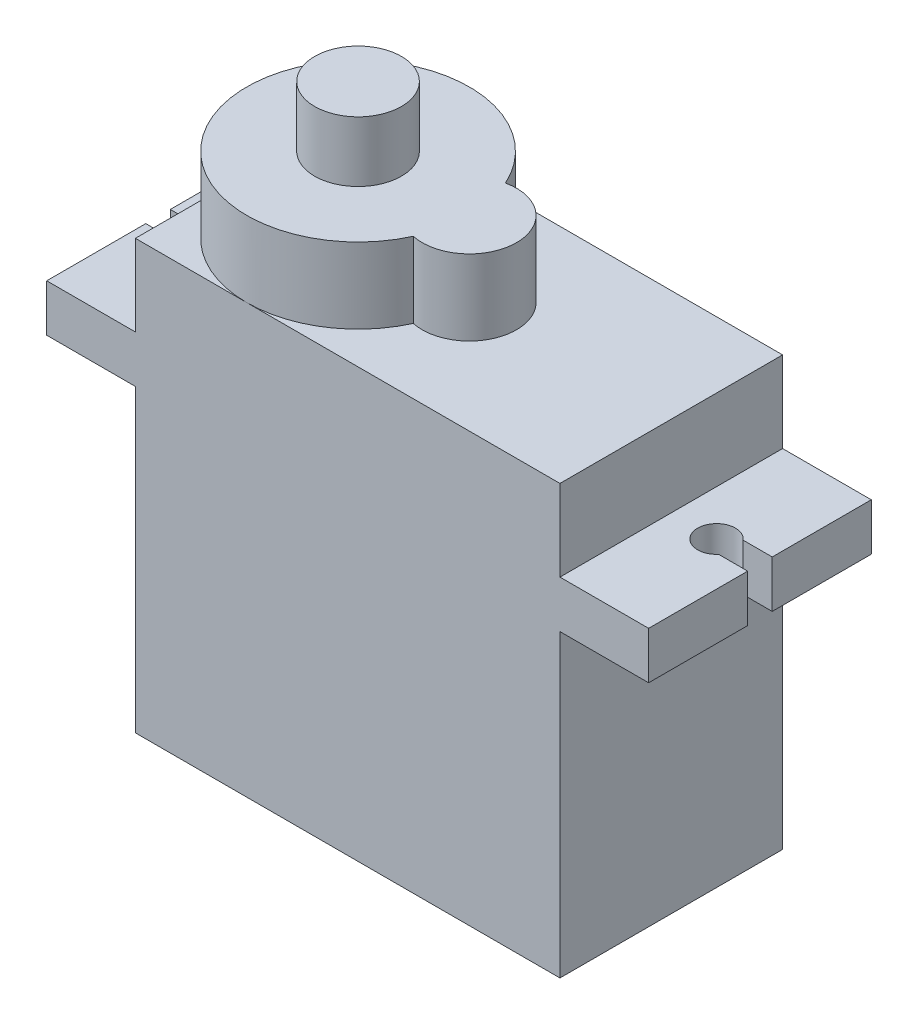
ISO-10303-21;
HEADER;
FILE_DESCRIPTION(('STEP AP214'),'2;1');
FILE_NAME('part.step','',(''),(''),'','','');
FILE_SCHEMA(('AUTOMOTIVE_DESIGN { 1 0 10303 214 1 1 1 1 }'));
ENDSEC;
DATA;
#1=APPLICATION_CONTEXT('core data for automotive mechanical design processes');
#2=APPLICATION_PROTOCOL_DEFINITION('international standard','automotive_design',2000,#1);
#3=PRODUCT_CONTEXT('',#1,'mechanical');
#4=PRODUCT('Part','Part','',(#3));
#5=PRODUCT_RELATED_PRODUCT_CATEGORY('part','',(#4));
#6=PRODUCT_DEFINITION_FORMATION('','',#4);
#7=PRODUCT_DEFINITION_CONTEXT('part definition',#1,'design');
#8=PRODUCT_DEFINITION('design','',#6,#7);
#9=PRODUCT_DEFINITION_SHAPE('','',#8);
#10=(LENGTH_UNIT() NAMED_UNIT(*) SI_UNIT(.MILLI.,.METRE.));
#11=(NAMED_UNIT(*) PLANE_ANGLE_UNIT() SI_UNIT($,.RADIAN.));
#12=(NAMED_UNIT(*) SI_UNIT($,.STERADIAN.) SOLID_ANGLE_UNIT());
#13=UNCERTAINTY_MEASURE_WITH_UNIT(LENGTH_MEASURE(1.E-05),#10,'distance_accuracy_value','');
#14=(GEOMETRIC_REPRESENTATION_CONTEXT(3) GLOBAL_UNCERTAINTY_ASSIGNED_CONTEXT((#13)) GLOBAL_UNIT_ASSIGNED_CONTEXT((#10,
#11,#12)) REPRESENTATION_CONTEXT('',''));
#15=CARTESIAN_POINT('',(0.,0.,0.));
#16=DIRECTION('',(0.,0.,1.));
#17=DIRECTION('',(1.,0.,0.));
#18=AXIS2_PLACEMENT_3D('',#15,#16,#17);
#19=CARTESIAN_POINT('',(-4.7,18.4,11.8));
#20=DIRECTION('',(1.,0.,0.));
#21=DIRECTION('',(0.,0.,-1.));
#22=AXIS2_PLACEMENT_3D('',#19,#20,#21);
#23=PLANE('',#22);
#24=DIRECTION('',(0.,0.,-1.));
#25=VECTOR('',#24,1.);
#26=CARTESIAN_POINT('',(-4.7,15.9,11.8));
#27=LINE('',#26,#25);
#28=CARTESIAN_POINT('',(-4.7,15.9,5.25));
#29=VERTEX_POINT('',#28);
#30=CARTESIAN_POINT('',(-4.7,15.9,0.));
#31=VERTEX_POINT('',#30);
#32=EDGE_CURVE('E376',#29,#31,#27,.T.);
#33=ORIENTED_EDGE('',*,*,#32,.F.);
#34=DIRECTION('',(0.,1.,0.));
#35=VECTOR('',#34,1.);
#36=CARTESIAN_POINT('',(-4.7,15.2,5.25));
#37=LINE('',#36,#35);
#38=CARTESIAN_POINT('',(-4.7,18.4,5.25));
#39=VERTEX_POINT('',#38);
#40=EDGE_CURVE('E264',#29,#39,#37,.T.);
#41=ORIENTED_EDGE('',*,*,#40,.T.);
#42=DIRECTION('',(0.,0.,-1.));
#43=VECTOR('',#42,1.);
#44=CARTESIAN_POINT('',(-4.7,18.4,11.8));
#45=LINE('',#44,#43);
#46=CARTESIAN_POINT('',(-4.7,18.4,0.));
#47=VERTEX_POINT('',#46);
#48=EDGE_CURVE('E218',#39,#47,#45,.T.);
#49=ORIENTED_EDGE('',*,*,#48,.T.);
#50=DIRECTION('',(0.,-1.,0.));
#51=VECTOR('',#50,1.);
#52=CARTESIAN_POINT('',(-4.7,18.4,0.));
#53=LINE('',#52,#51);
#54=EDGE_CURVE('E372',#47,#31,#53,.T.);
#55=ORIENTED_EDGE('',*,*,#54,.T.);
#56=EDGE_LOOP('',(#33,#41,#49,#55));
#57=FACE_BOUND('',#56,.T.);
#58=ADVANCED_FACE('F34',(#57),#23,.F.);
#59=CARTESIAN_POINT('',(27.2,15.9,11.8));
#60=DIRECTION('',(-1.,0.,0.));
#61=DIRECTION('',(0.,0.,1.));
#62=AXIS2_PLACEMENT_3D('',#59,#60,#61);
#63=PLANE('',#62);
#64=DIRECTION('',(0.,0.,-1.));
#65=VECTOR('',#64,1.);
#66=CARTESIAN_POINT('',(27.2,15.9,11.8));
#67=LINE('',#66,#65);
#68=CARTESIAN_POINT('',(27.2,15.9,11.8));
#69=VERTEX_POINT('',#68);
#70=CARTESIAN_POINT('',(27.2,15.9,6.55));
#71=VERTEX_POINT('',#70);
#72=EDGE_CURVE('E241',#69,#71,#67,.T.);
#73=ORIENTED_EDGE('',*,*,#72,.T.);
#74=DIRECTION('',(0.,1.,0.));
#75=VECTOR('',#74,1.);
#76=CARTESIAN_POINT('',(27.2,15.2,6.55));
#77=LINE('',#76,#75);
#78=CARTESIAN_POINT('',(27.2,18.4,6.55));
#79=VERTEX_POINT('',#78);
#80=EDGE_CURVE('E278',#71,#79,#77,.T.);
#81=ORIENTED_EDGE('',*,*,#80,.T.);
#82=DIRECTION('',(0.,0.,-1.));
#83=VECTOR('',#82,1.);
#84=CARTESIAN_POINT('',(27.2,18.4,11.8));
#85=LINE('',#84,#83);
#86=CARTESIAN_POINT('',(27.2,18.4,11.8));
#87=VERTEX_POINT('',#86);
#88=EDGE_CURVE('E237',#87,#79,#85,.T.);
#89=ORIENTED_EDGE('',*,*,#88,.F.);
#90=DIRECTION('',(0.,1.,0.));
#91=VECTOR('',#90,1.);
#92=CARTESIAN_POINT('',(27.2,15.9,11.8));
#93=LINE('',#92,#91);
#94=EDGE_CURVE('E329',#69,#87,#93,.T.);
#95=ORIENTED_EDGE('',*,*,#94,.F.);
#96=EDGE_LOOP('',(#73,#81,#89,#95));
#97=FACE_BOUND('',#96,.T.);
#98=ADVANCED_FACE('F409',(#97),#63,.F.);
#99=CARTESIAN_POINT('',(22.5,22.7,11.8));
#100=DIRECTION('',(0.,-1.,0.));
#101=DIRECTION('',(0.,0.,-1.));
#102=AXIS2_PLACEMENT_3D('',#99,#100,#101);
#103=PLANE('',#102);
#104=CARTESIAN_POINT('',(11.8,22.7,5.9));
#105=DIRECTION('',(0.,1.,0.));
#106=DIRECTION('',(0.,0.,1.));
#107=AXIS2_PLACEMENT_3D('',#104,#105,#106);
#108=CIRCLE('',#107,2.5);
#109=CARTESIAN_POINT('',(11.2703389830509,22.7,8.34324767617293));
#110=VERTEX_POINT('',#109);
#111=CARTESIAN_POINT('',(11.2703389830509,22.7,3.45675232382708));
#112=VERTEX_POINT('',#111);
#113=EDGE_CURVE('E299',#110,#112,#108,.T.);
#114=ORIENTED_EDGE('',*,*,#113,.F.);
#115=CARTESIAN_POINT('',(5.9,22.7,5.9));
#116=DIRECTION('',(0.,1.,0.));
#117=DIRECTION('',(0.,0.,1.));
#118=AXIS2_PLACEMENT_3D('',#115,#116,#117);
#119=CIRCLE('',#118,5.9);
#120=CARTESIAN_POINT('',(5.9,22.7,11.8));
#121=VERTEX_POINT('',#120);
#122=EDGE_CURVE('E253',#121,#110,#119,.T.);
#123=ORIENTED_EDGE('',*,*,#122,.F.);
#124=DIRECTION('',(-1.,0.,0.));
#125=VECTOR('',#124,1.);
#126=CARTESIAN_POINT('',(22.5,22.7,11.8));
#127=LINE('',#126,#125);
#128=CARTESIAN_POINT('',(22.5,22.7,11.8));
#129=VERTEX_POINT('',#128);
#130=EDGE_CURVE('E336',#129,#121,#127,.T.);
#131=ORIENTED_EDGE('',*,*,#130,.F.);
#132=DIRECTION('',(0.,0.,-1.));
#133=VECTOR('',#132,1.);
#134=CARTESIAN_POINT('',(22.5,22.7,11.8));
#135=LINE('',#134,#133);
#136=CARTESIAN_POINT('',(22.5,22.7,0.));
#137=VERTEX_POINT('',#136);
#138=EDGE_CURVE('E230',#129,#137,#135,.T.);
#139=ORIENTED_EDGE('',*,*,#138,.T.);
#140=DIRECTION('',(-1.,0.,0.));
#141=VECTOR('',#140,1.);
#142=CARTESIAN_POINT('',(22.5,22.7,0.));
#143=LINE('',#142,#141);
#144=CARTESIAN_POINT('',(5.9,22.7,0.));
#145=VERTEX_POINT('',#144);
#146=EDGE_CURVE('E364',#137,#145,#143,.T.);
#147=ORIENTED_EDGE('',*,*,#146,.T.);
#148=EDGE_CURVE('E306',#112,#145,#119,.T.);
#149=ORIENTED_EDGE('',*,*,#148,.F.);
#150=EDGE_LOOP('',(#114,#123,#131,#139,#147,#149));
#151=FACE_BOUND('',#150,.T.);
#152=ADVANCED_FACE('F414',(#151),#103,.F.);
#153=CARTESIAN_POINT('',(0.,22.7,5.9));
#154=VERTEX_POINT('',#153);
#155=EDGE_CURVE('E254',#145,#154,#119,.T.);
#156=ORIENTED_EDGE('',*,*,#155,.F.);
#157=CARTESIAN_POINT('',(0.,22.7,0.));
#158=VERTEX_POINT('',#157);
#159=EDGE_CURVE('E363',#145,#158,#143,.T.);
#160=ORIENTED_EDGE('',*,*,#159,.T.);
#161=DIRECTION('',(0.,0.,-1.));
#162=VECTOR('',#161,1.);
#163=CARTESIAN_POINT('',(0.,22.7,11.8));
#164=LINE('',#163,#162);
#165=EDGE_CURVE('E221',#154,#158,#164,.T.);
#166=ORIENTED_EDGE('',*,*,#165,.F.);
#167=EDGE_LOOP('',(#156,#160,#166));
#168=FACE_BOUND('',#167,.T.);
#169=ADVANCED_FACE('F436',(#168),#103,.F.);
#170=CARTESIAN_POINT('',(0.,15.9,11.8));
#171=DIRECTION('',(1.,0.,0.));
#172=DIRECTION('',(0.,0.,-1.));
#173=AXIS2_PLACEMENT_3D('',#170,#171,#172);
#174=PLANE('',#173);
#175=DIRECTION('',(0.,-1.,0.));
#176=VECTOR('',#175,1.);
#177=CARTESIAN_POINT('',(0.,15.9,0.));
#178=LINE('',#177,#176);
#179=CARTESIAN_POINT('',(0.,15.9,0.));
#180=VERTEX_POINT('',#179);
#181=CARTESIAN_POINT('',(0.,0.,0.));
#182=VERTEX_POINT('',#181);
#183=EDGE_CURVE('E318',#180,#182,#178,.T.);
#184=ORIENTED_EDGE('',*,*,#183,.T.);
#185=DIRECTION('',(0.,0.,-1.));
#186=VECTOR('',#185,1.);
#187=CARTESIAN_POINT('',(0.,0.,11.8));
#188=LINE('',#187,#186);
#189=CARTESIAN_POINT('',(0.,0.,11.8));
#190=VERTEX_POINT('',#189);
#191=EDGE_CURVE('E250',#190,#182,#188,.T.);
#192=ORIENTED_EDGE('',*,*,#191,.F.);
#193=DIRECTION('',(0.,-1.,0.));
#194=VECTOR('',#193,1.);
#195=CARTESIAN_POINT('',(0.,15.9,11.8));
#196=LINE('',#195,#194);
#197=CARTESIAN_POINT('',(0.,15.9,11.8));
#198=VERTEX_POINT('',#197);
#199=EDGE_CURVE('E319',#198,#190,#196,.T.);
#200=ORIENTED_EDGE('',*,*,#199,.F.);
#201=DIRECTION('',(0.,0.,-1.));
#202=VECTOR('',#201,1.);
#203=CARTESIAN_POINT('',(0.,15.9,11.8));
#204=LINE('',#203,#202);
#205=EDGE_CURVE('E346',#198,#180,#204,.T.);
#206=ORIENTED_EDGE('',*,*,#205,.T.);
#207=EDGE_LOOP('',(#184,#192,#200,#206));
#208=FACE_BOUND('',#207,.T.);
#209=ADVANCED_FACE('F36',(#208),#174,.F.);
#210=CARTESIAN_POINT('',(0.,0.,11.8));
#211=DIRECTION('',(0.,1.,0.));
#212=DIRECTION('',(0.,0.,1.));
#213=AXIS2_PLACEMENT_3D('',#210,#211,#212);
#214=PLANE('',#213);
#215=DIRECTION('',(1.,0.,0.));
#216=VECTOR('',#215,1.);
#217=CARTESIAN_POINT('',(0.,0.,0.));
#218=LINE('',#217,#216);
#219=CARTESIAN_POINT('',(22.5,0.,0.));
#220=VERTEX_POINT('',#219);
#221=EDGE_CURVE('E349',#182,#220,#218,.T.);
#222=ORIENTED_EDGE('',*,*,#221,.T.);
#223=DIRECTION('',(0.,0.,-1.));
#224=VECTOR('',#223,1.);
#225=CARTESIAN_POINT('',(22.5,0.,11.8));
#226=LINE('',#225,#224);
#227=CARTESIAN_POINT('',(22.5,0.,11.8));
#228=VERTEX_POINT('',#227);
#229=EDGE_CURVE('E247',#228,#220,#226,.T.);
#230=ORIENTED_EDGE('',*,*,#229,.F.);
#231=DIRECTION('',(1.,0.,0.));
#232=VECTOR('',#231,1.);
#233=CARTESIAN_POINT('',(0.,0.,11.8));
#234=LINE('',#233,#232);
#235=EDGE_CURVE('E322',#190,#228,#234,.T.);
#236=ORIENTED_EDGE('',*,*,#235,.F.);
#237=ORIENTED_EDGE('',*,*,#191,.T.);
#238=EDGE_LOOP('',(#222,#230,#236,#237));
#239=FACE_BOUND('',#238,.T.);
#240=ADVANCED_FACE('F452',(#239),#214,.F.);
#241=CARTESIAN_POINT('',(22.5,0.,11.8));
#242=DIRECTION('',(-1.,0.,0.));
#243=DIRECTION('',(0.,0.,1.));
#244=AXIS2_PLACEMENT_3D('',#241,#242,#243);
#245=PLANE('',#244);
#246=DIRECTION('',(0.,1.,0.));
#247=VECTOR('',#246,1.);
#248=CARTESIAN_POINT('',(22.5,0.,0.));
#249=LINE('',#248,#247);
#250=CARTESIAN_POINT('',(22.5,15.9,0.));
#251=VERTEX_POINT('',#250);
#252=EDGE_CURVE('E351',#220,#251,#249,.T.);
#253=ORIENTED_EDGE('',*,*,#252,.T.);
#254=DIRECTION('',(0.,0.,-1.));
#255=VECTOR('',#254,1.);
#256=CARTESIAN_POINT('',(22.5,15.9,11.8));
#257=LINE('',#256,#255);
#258=CARTESIAN_POINT('',(22.5,15.9,11.8));
#259=VERTEX_POINT('',#258);
#260=EDGE_CURVE('E244',#259,#251,#257,.T.);
#261=ORIENTED_EDGE('',*,*,#260,.F.);
#262=DIRECTION('',(0.,1.,0.));
#263=VECTOR('',#262,1.);
#264=CARTESIAN_POINT('',(22.5,0.,11.8));
#265=LINE('',#264,#263);
#266=EDGE_CURVE('E325',#228,#259,#265,.T.);
#267=ORIENTED_EDGE('',*,*,#266,.F.);
#268=ORIENTED_EDGE('',*,*,#229,.T.);
#269=EDGE_LOOP('',(#253,#261,#267,#268));
#270=FACE_BOUND('',#269,.T.);
#271=ADVANCED_FACE('F449',(#270),#245,.F.);
#272=CARTESIAN_POINT('',(22.5,15.9,11.8));
#273=DIRECTION('',(0.,1.,0.));
#274=DIRECTION('',(0.,0.,1.));
#275=AXIS2_PLACEMENT_3D('',#272,#273,#274);
#276=PLANE('',#275);
#277=CARTESIAN_POINT('',(24.9,15.9,5.9));
#278=DIRECTION('',(0.,1.,0.));
#279=DIRECTION('',(0.,0.,1.));
#280=AXIS2_PLACEMENT_3D('',#277,#278,#279);
#281=CIRCLE('',#280,1.);
#282=CARTESIAN_POINT('',(25.6599342076785,15.9,5.25));
#283=VERTEX_POINT('',#282);
#284=CARTESIAN_POINT('',(25.6599342076785,15.9,6.55));
#285=VERTEX_POINT('',#284);
#286=EDGE_CURVE('E289',#283,#285,#281,.T.);
#287=ORIENTED_EDGE('',*,*,#286,.T.);
#288=DIRECTION('',(1.,0.,0.));
#289=VECTOR('',#288,1.);
#290=CARTESIAN_POINT('',(22.5,15.9,6.55));
#291=LINE('',#290,#289);
#292=EDGE_CURVE('E292',#285,#71,#291,.T.);
#293=ORIENTED_EDGE('',*,*,#292,.T.);
#294=ORIENTED_EDGE('',*,*,#72,.F.);
#295=DIRECTION('',(1.,0.,0.));
#296=VECTOR('',#295,1.);
#297=CARTESIAN_POINT('',(22.5,15.9,11.8));
#298=LINE('',#297,#296);
#299=EDGE_CURVE('E327',#259,#69,#298,.T.);
#300=ORIENTED_EDGE('',*,*,#299,.F.);
#301=ORIENTED_EDGE('',*,*,#260,.T.);
#302=DIRECTION('',(1.,0.,0.));
#303=VECTOR('',#302,1.);
#304=CARTESIAN_POINT('',(22.5,15.9,0.));
#305=LINE('',#304,#303);
#306=CARTESIAN_POINT('',(27.2,15.9,0.));
#307=VERTEX_POINT('',#306);
#308=EDGE_CURVE('E353',#251,#307,#305,.T.);
#309=ORIENTED_EDGE('',*,*,#308,.T.);
#310=CARTESIAN_POINT('',(27.2,15.9,5.25));
#311=VERTEX_POINT('',#310);
#312=EDGE_CURVE('E240',#311,#307,#67,.T.);
#313=ORIENTED_EDGE('',*,*,#312,.F.);
#314=DIRECTION('',(-1.,0.,0.));
#315=VECTOR('',#314,1.);
#316=CARTESIAN_POINT('',(22.5,15.9,5.25));
#317=LINE('',#316,#315);
#318=EDGE_CURVE('E281',#311,#283,#317,.T.);
#319=ORIENTED_EDGE('',*,*,#318,.T.);
#320=EDGE_LOOP('',(#287,#293,#294,#300,#301,#309,#313,#319));
#321=FACE_BOUND('',#320,.T.);
#322=ADVANCED_FACE('F445',(#321),#276,.F.);
#323=CARTESIAN_POINT('',(27.2,18.4,5.25));
#324=VERTEX_POINT('',#323);
#325=CARTESIAN_POINT('',(27.2,18.4,0.));
#326=VERTEX_POINT('',#325);
#327=EDGE_CURVE('E236',#324,#326,#85,.T.);
#328=ORIENTED_EDGE('',*,*,#327,.F.);
#329=DIRECTION('',(0.,1.,0.));
#330=VECTOR('',#329,1.);
#331=CARTESIAN_POINT('',(27.2,15.2,5.25));
#332=LINE('',#331,#330);
#333=EDGE_CURVE('E57',#311,#324,#332,.T.);
#334=ORIENTED_EDGE('',*,*,#333,.F.);
#335=ORIENTED_EDGE('',*,*,#312,.T.);
#336=DIRECTION('',(0.,1.,0.));
#337=VECTOR('',#336,1.);
#338=CARTESIAN_POINT('',(27.2,15.9,0.));
#339=LINE('',#338,#337);
#340=EDGE_CURVE('E356',#307,#326,#339,.T.);
#341=ORIENTED_EDGE('',*,*,#340,.T.);
#342=EDGE_LOOP('',(#328,#334,#335,#341));
#343=FACE_BOUND('',#342,.T.);
#344=ADVANCED_FACE('F417',(#343),#63,.F.);
#345=CARTESIAN_POINT('',(27.2,18.4,11.8));
#346=DIRECTION('',(0.,-1.,0.));
#347=DIRECTION('',(0.,0.,-1.));
#348=AXIS2_PLACEMENT_3D('',#345,#346,#347);
#349=PLANE('',#348);
#350=ORIENTED_EDGE('',*,*,#88,.T.);
#351=DIRECTION('',(1.,0.,0.));
#352=VECTOR('',#351,1.);
#353=CARTESIAN_POINT('',(27.2,18.4,6.55));
#354=LINE('',#353,#352);
#355=CARTESIAN_POINT('',(25.6599342076785,18.4,6.55));
#356=VERTEX_POINT('',#355);
#357=EDGE_CURVE('E276',#356,#79,#354,.T.);
#358=ORIENTED_EDGE('',*,*,#357,.F.);
#359=CARTESIAN_POINT('',(24.9,18.4,5.9));
#360=DIRECTION('',(0.,1.,0.));
#361=DIRECTION('',(0.,0.,1.));
#362=AXIS2_PLACEMENT_3D('',#359,#360,#361);
#363=CIRCLE('',#362,1.);
#364=CARTESIAN_POINT('',(25.6599342076785,18.4,5.25));
#365=VERTEX_POINT('',#364);
#366=EDGE_CURVE('E273',#365,#356,#363,.T.);
#367=ORIENTED_EDGE('',*,*,#366,.F.);
#368=DIRECTION('',(-1.,0.,0.));
#369=VECTOR('',#368,1.);
#370=CARTESIAN_POINT('',(27.2,18.4,5.25));
#371=LINE('',#370,#369);
#372=EDGE_CURVE('E267',#324,#365,#371,.T.);
#373=ORIENTED_EDGE('',*,*,#372,.F.);
#374=ORIENTED_EDGE('',*,*,#327,.T.);
#375=DIRECTION('',(-1.,0.,0.));
#376=VECTOR('',#375,1.);
#377=CARTESIAN_POINT('',(27.2,18.4,0.));
#378=LINE('',#377,#376);
#379=CARTESIAN_POINT('',(22.5,18.4,0.));
#380=VERTEX_POINT('',#379);
#381=EDGE_CURVE('E359',#326,#380,#378,.T.);
#382=ORIENTED_EDGE('',*,*,#381,.T.);
#383=DIRECTION('',(0.,0.,-1.));
#384=VECTOR('',#383,1.);
#385=CARTESIAN_POINT('',(22.5,18.4,11.8));
#386=LINE('',#385,#384);
#387=CARTESIAN_POINT('',(22.5,18.4,11.8));
#388=VERTEX_POINT('',#387);
#389=EDGE_CURVE('E233',#388,#380,#386,.T.);
#390=ORIENTED_EDGE('',*,*,#389,.F.);
#391=DIRECTION('',(-1.,0.,0.));
#392=VECTOR('',#391,1.);
#393=CARTESIAN_POINT('',(27.2,18.4,11.8));
#394=LINE('',#393,#392);
#395=EDGE_CURVE('E331',#87,#388,#394,.T.);
#396=ORIENTED_EDGE('',*,*,#395,.F.);
#397=EDGE_LOOP('',(#350,#358,#367,#373,#374,#382,#390,#396));
#398=FACE_BOUND('',#397,.T.);
#399=ADVANCED_FACE('F439',(#398),#349,.F.);
#400=CARTESIAN_POINT('',(22.5,18.4,11.8));
#401=DIRECTION('',(-1.,0.,0.));
#402=DIRECTION('',(0.,0.,1.));
#403=AXIS2_PLACEMENT_3D('',#400,#401,#402);
#404=PLANE('',#403);
#405=DIRECTION('',(0.,1.,0.));
#406=VECTOR('',#405,1.);
#407=CARTESIAN_POINT('',(22.5,18.4,0.));
#408=LINE('',#407,#406);
#409=EDGE_CURVE('E361',#380,#137,#408,.T.);
#410=ORIENTED_EDGE('',*,*,#409,.T.);
#411=ORIENTED_EDGE('',*,*,#138,.F.);
#412=DIRECTION('',(0.,1.,0.));
#413=VECTOR('',#412,1.);
#414=CARTESIAN_POINT('',(22.5,18.4,11.8));
#415=LINE('',#414,#413);
#416=EDGE_CURVE('E333',#388,#129,#415,.T.);
#417=ORIENTED_EDGE('',*,*,#416,.F.);
#418=ORIENTED_EDGE('',*,*,#389,.T.);
#419=EDGE_LOOP('',(#410,#411,#417,#418));
#420=FACE_BOUND('',#419,.T.);
#421=ADVANCED_FACE('F434',(#420),#404,.F.);
#422=EDGE_CURVE('E485',#154,#121,#119,.T.);
#423=ORIENTED_EDGE('',*,*,#422,.F.);
#424=CARTESIAN_POINT('',(0.,22.7,11.8));
#425=VERTEX_POINT('',#424);
#426=EDGE_CURVE('E227',#425,#154,#164,.T.);
#427=ORIENTED_EDGE('',*,*,#426,.F.);
#428=EDGE_CURVE('E335',#121,#425,#127,.T.);
#429=ORIENTED_EDGE('',*,*,#428,.F.);
#430=EDGE_LOOP('',(#423,#427,#429));
#431=FACE_BOUND('',#430,.T.);
#432=ADVANCED_FACE('F429',(#431),#103,.F.);
#433=CARTESIAN_POINT('',(0.,22.7,11.8));
#434=DIRECTION('',(1.,0.,0.));
#435=DIRECTION('',(0.,0.,-1.));
#436=AXIS2_PLACEMENT_3D('',#433,#434,#435);
#437=PLANE('',#436);
#438=DIRECTION('',(0.,-1.,0.));
#439=VECTOR('',#438,1.);
#440=CARTESIAN_POINT('',(0.,22.7,0.));
#441=LINE('',#440,#439);
#442=CARTESIAN_POINT('',(0.,18.4,0.));
#443=VERTEX_POINT('',#442);
#444=EDGE_CURVE('E367',#158,#443,#441,.T.);
#445=ORIENTED_EDGE('',*,*,#444,.T.);
#446=DIRECTION('',(0.,0.,-1.));
#447=VECTOR('',#446,1.);
#448=CARTESIAN_POINT('',(0.,18.4,11.8));
#449=LINE('',#448,#447);
#450=CARTESIAN_POINT('',(0.,18.4,11.8));
#451=VERTEX_POINT('',#450);
#452=EDGE_CURVE('E217',#451,#443,#449,.T.);
#453=ORIENTED_EDGE('',*,*,#452,.F.);
#454=DIRECTION('',(0.,-1.,0.));
#455=VECTOR('',#454,1.);
#456=CARTESIAN_POINT('',(0.,22.7,11.8));
#457=LINE('',#456,#455);
#458=EDGE_CURVE('E339',#425,#451,#457,.T.);
#459=ORIENTED_EDGE('',*,*,#458,.F.);
#460=ORIENTED_EDGE('',*,*,#426,.T.);
#461=ORIENTED_EDGE('',*,*,#165,.T.);
#462=EDGE_LOOP('',(#445,#453,#459,#460,#461));
#463=FACE_BOUND('',#462,.T.);
#464=ADVANCED_FACE('F425',(#463),#437,.F.);
#465=CARTESIAN_POINT('',(0.,18.4,11.8));
#466=DIRECTION('',(0.,-1.,0.));
#467=DIRECTION('',(0.,0.,-1.));
#468=AXIS2_PLACEMENT_3D('',#465,#466,#467);
#469=PLANE('',#468);
#470=ORIENTED_EDGE('',*,*,#48,.F.);
#471=DIRECTION('',(-1.,0.,0.));
#472=VECTOR('',#471,1.);
#473=CARTESIAN_POINT('',(-4.7,18.4,5.25));
#474=LINE('',#473,#472);
#475=CARTESIAN_POINT('',(-3.15993420767853,18.4,5.25));
#476=VERTEX_POINT('',#475);
#477=EDGE_CURVE('E202',#476,#39,#474,.T.);
#478=ORIENTED_EDGE('',*,*,#477,.F.);
#479=CARTESIAN_POINT('',(-2.4,18.4,5.9));
#480=DIRECTION('',(0.,1.,0.));
#481=DIRECTION('',(0.,0.,1.));
#482=AXIS2_PLACEMENT_3D('',#479,#480,#481);
#483=CIRCLE('',#482,1.);
#484=CARTESIAN_POINT('',(-3.15993420767853,18.4,6.55));
#485=VERTEX_POINT('',#484);
#486=EDGE_CURVE('E213',#485,#476,#483,.T.);
#487=ORIENTED_EDGE('',*,*,#486,.F.);
#488=DIRECTION('',(1.,0.,0.));
#489=VECTOR('',#488,1.);
#490=CARTESIAN_POINT('',(-4.7,18.4,6.55));
#491=LINE('',#490,#489);
#492=CARTESIAN_POINT('',(-4.7,18.4,6.55));
#493=VERTEX_POINT('',#492);
#494=EDGE_CURVE('E194',#493,#485,#491,.T.);
#495=ORIENTED_EDGE('',*,*,#494,.F.);
#496=CARTESIAN_POINT('',(-4.7,18.4,11.8));
#497=VERTEX_POINT('',#496);
#498=EDGE_CURVE('E209',#497,#493,#45,.T.);
#499=ORIENTED_EDGE('',*,*,#498,.F.);
#500=DIRECTION('',(-1.,0.,0.));
#501=VECTOR('',#500,1.);
#502=CARTESIAN_POINT('',(0.,18.4,11.8));
#503=LINE('',#502,#501);
#504=EDGE_CURVE('E341',#451,#497,#503,.T.);
#505=ORIENTED_EDGE('',*,*,#504,.F.);
#506=ORIENTED_EDGE('',*,*,#452,.T.);
#507=DIRECTION('',(-1.,0.,0.));
#508=VECTOR('',#507,1.);
#509=CARTESIAN_POINT('',(0.,18.4,0.));
#510=LINE('',#509,#508);
#511=EDGE_CURVE('E369',#443,#47,#510,.T.);
#512=ORIENTED_EDGE('',*,*,#511,.T.);
#513=EDGE_LOOP('',(#470,#478,#487,#495,#499,#505,#506,#512));
#514=FACE_BOUND('',#513,.T.);
#515=ADVANCED_FACE('F207',(#514),#469,.F.);
#516=ORIENTED_EDGE('',*,*,#498,.T.);
#517=DIRECTION('',(0.,1.,0.));
#518=VECTOR('',#517,1.);
#519=CARTESIAN_POINT('',(-4.7,15.2,6.55));
#520=LINE('',#519,#518);
#521=CARTESIAN_POINT('',(-4.7,15.9,6.55));
#522=VERTEX_POINT('',#521);
#523=EDGE_CURVE('E191',#522,#493,#520,.T.);
#524=ORIENTED_EDGE('',*,*,#523,.F.);
#525=CARTESIAN_POINT('',(-4.7,15.9,11.8));
#526=VERTEX_POINT('',#525);
#527=EDGE_CURVE('E223',#526,#522,#27,.T.);
#528=ORIENTED_EDGE('',*,*,#527,.F.);
#529=DIRECTION('',(0.,-1.,0.));
#530=VECTOR('',#529,1.);
#531=CARTESIAN_POINT('',(-4.7,18.4,11.8));
#532=LINE('',#531,#530);
#533=EDGE_CURVE('E216',#497,#526,#532,.T.);
#534=ORIENTED_EDGE('',*,*,#533,.F.);
#535=EDGE_LOOP('',(#516,#524,#528,#534));
#536=FACE_BOUND('',#535,.T.);
#537=ADVANCED_FACE('F215',(#536),#23,.F.);
#538=CARTESIAN_POINT('',(-4.7,15.9,11.8));
#539=DIRECTION('',(0.,1.,0.));
#540=DIRECTION('',(0.,0.,1.));
#541=AXIS2_PLACEMENT_3D('',#538,#539,#540);
#542=PLANE('',#541);
#543=CARTESIAN_POINT('',(-2.4,15.9,5.9));
#544=DIRECTION('',(0.,1.,0.));
#545=DIRECTION('',(0.,0.,1.));
#546=AXIS2_PLACEMENT_3D('',#543,#544,#545);
#547=CIRCLE('',#546,1.);
#548=CARTESIAN_POINT('',(-3.15993420767853,15.9,6.55));
#549=VERTEX_POINT('',#548);
#550=CARTESIAN_POINT('',(-3.15993420767853,15.9,5.25));
#551=VERTEX_POINT('',#550);
#552=EDGE_CURVE('E42',#549,#551,#547,.T.);
#553=ORIENTED_EDGE('',*,*,#552,.T.);
#554=DIRECTION('',(-1.,0.,0.));
#555=VECTOR('',#554,1.);
#556=CARTESIAN_POINT('',(-4.7,15.9,5.25));
#557=LINE('',#556,#555);
#558=EDGE_CURVE('E11',#551,#29,#557,.T.);
#559=ORIENTED_EDGE('',*,*,#558,.T.);
#560=ORIENTED_EDGE('',*,*,#32,.T.);
#561=DIRECTION('',(1.,0.,0.));
#562=VECTOR('',#561,1.);
#563=CARTESIAN_POINT('',(-4.7,15.9,0.));
#564=LINE('',#563,#562);
#565=EDGE_CURVE('E323',#31,#180,#564,.T.);
#566=ORIENTED_EDGE('',*,*,#565,.T.);
#567=ORIENTED_EDGE('',*,*,#205,.F.);
#568=DIRECTION('',(1.,0.,0.));
#569=VECTOR('',#568,1.);
#570=CARTESIAN_POINT('',(-4.7,15.9,11.8));
#571=LINE('',#570,#569);
#572=EDGE_CURVE('E344',#526,#198,#571,.T.);
#573=ORIENTED_EDGE('',*,*,#572,.F.);
#574=ORIENTED_EDGE('',*,*,#527,.T.);
#575=DIRECTION('',(1.,0.,0.));
#576=VECTOR('',#575,1.);
#577=CARTESIAN_POINT('',(-4.7,15.9,6.55));
#578=LINE('',#577,#576);
#579=EDGE_CURVE('E197',#522,#549,#578,.T.);
#580=ORIENTED_EDGE('',*,*,#579,.T.);
#581=EDGE_LOOP('',(#553,#559,#560,#566,#567,#573,#574,#580));
#582=FACE_BOUND('',#581,.T.);
#583=ADVANCED_FACE('F257',(#582),#542,.F.);
#584=CARTESIAN_POINT('',(0.,0.,11.8));
#585=DIRECTION('',(0.,0.,1.));
#586=DIRECTION('',(1.,0.,0.));
#587=AXIS2_PLACEMENT_3D('',#584,#585,#586);
#588=PLANE('',#587);
#589=ORIENTED_EDGE('',*,*,#199,.T.);
#590=ORIENTED_EDGE('',*,*,#235,.T.);
#591=ORIENTED_EDGE('',*,*,#266,.T.);
#592=ORIENTED_EDGE('',*,*,#299,.T.);
#593=ORIENTED_EDGE('',*,*,#94,.T.);
#594=ORIENTED_EDGE('',*,*,#395,.T.);
#595=ORIENTED_EDGE('',*,*,#416,.T.);
#596=ORIENTED_EDGE('',*,*,#130,.T.);
#597=ORIENTED_EDGE('',*,*,#428,.T.);
#598=ORIENTED_EDGE('',*,*,#458,.T.);
#599=ORIENTED_EDGE('',*,*,#504,.T.);
#600=ORIENTED_EDGE('',*,*,#533,.T.);
#601=ORIENTED_EDGE('',*,*,#572,.T.);
#602=EDGE_LOOP('',(#589,#590,#591,#592,#593,#594,#595,#596,#597,#598,#599,#600,#601));
#603=FACE_BOUND('',#602,.T.);
#604=ADVANCED_FACE('F383',(#603),#588,.T.);
#605=CARTESIAN_POINT('',(0.,0.,0.));
#606=DIRECTION('',(0.,0.,1.));
#607=DIRECTION('',(1.,0.,0.));
#608=AXIS2_PLACEMENT_3D('',#605,#606,#607);
#609=PLANE('',#608);
#610=ORIENTED_EDGE('',*,*,#183,.F.);
#611=ORIENTED_EDGE('',*,*,#565,.F.);
#612=ORIENTED_EDGE('',*,*,#54,.F.);
#613=ORIENTED_EDGE('',*,*,#511,.F.);
#614=ORIENTED_EDGE('',*,*,#444,.F.);
#615=ORIENTED_EDGE('',*,*,#159,.F.);
#616=ORIENTED_EDGE('',*,*,#146,.F.);
#617=ORIENTED_EDGE('',*,*,#409,.F.);
#618=ORIENTED_EDGE('',*,*,#381,.F.);
#619=ORIENTED_EDGE('',*,*,#340,.F.);
#620=ORIENTED_EDGE('',*,*,#308,.F.);
#621=ORIENTED_EDGE('',*,*,#252,.F.);
#622=ORIENTED_EDGE('',*,*,#221,.F.);
#623=EDGE_LOOP('',(#610,#611,#612,#613,#614,#615,#616,#617,#618,#619,#620,#621,#622));
#624=FACE_BOUND('',#623,.T.);
#625=ADVANCED_FACE('F392',(#624),#609,.F.);
#626=CARTESIAN_POINT('',(11.8,26.7,5.9));
#627=DIRECTION('',(0.,-1.,0.));
#628=DIRECTION('',(0.,0.,-1.));
#629=AXIS2_PLACEMENT_3D('',#626,#627,#628);
#630=CYLINDRICAL_SURFACE('',#629,2.5);
#631=ORIENTED_EDGE('',*,*,#113,.T.);
#632=DIRECTION('',(0.,-1.,0.));
#633=VECTOR('',#632,1.);
#634=CARTESIAN_POINT('',(11.2703389830509,26.7,3.45675232382708));
#635=LINE('',#634,#633);
#636=CARTESIAN_POINT('',(11.2703389830509,26.7,3.45675232382708));
#637=VERTEX_POINT('',#636);
#638=EDGE_CURVE('E315',#637,#112,#635,.T.);
#639=ORIENTED_EDGE('',*,*,#638,.F.);
#640=CARTESIAN_POINT('',(11.8,26.7,5.9));
#641=DIRECTION('',(0.,1.,0.));
#642=DIRECTION('',(0.,0.,1.));
#643=AXIS2_PLACEMENT_3D('',#640,#641,#642);
#644=CIRCLE('',#643,2.5);
#645=CARTESIAN_POINT('',(11.2703389830509,26.7,8.34324767617293));
#646=VERTEX_POINT('',#645);
#647=EDGE_CURVE('E302',#646,#637,#644,.T.);
#648=ORIENTED_EDGE('',*,*,#647,.F.);
#649=DIRECTION('',(0.,-1.,0.));
#650=VECTOR('',#649,1.);
#651=CARTESIAN_POINT('',(11.2703389830509,26.7,8.34324767617293));
#652=LINE('',#651,#650);
#653=EDGE_CURVE('E308',#646,#110,#652,.T.);
#654=ORIENTED_EDGE('',*,*,#653,.T.);
#655=EDGE_LOOP('',(#631,#639,#648,#654));
#656=FACE_BOUND('',#655,.T.);
#657=ADVANCED_FACE('F495',(#656),#630,.T.);
#658=CARTESIAN_POINT('',(5.9,26.7,5.9));
#659=DIRECTION('',(0.,-1.,0.));
#660=DIRECTION('',(0.,0.,-1.));
#661=AXIS2_PLACEMENT_3D('',#658,#659,#660);
#662=CYLINDRICAL_SURFACE('',#661,5.9);
#663=ORIENTED_EDGE('',*,*,#148,.T.);
#664=ORIENTED_EDGE('',*,*,#155,.T.);
#665=ORIENTED_EDGE('',*,*,#422,.T.);
#666=ORIENTED_EDGE('',*,*,#122,.T.);
#667=ORIENTED_EDGE('',*,*,#653,.F.);
#668=CARTESIAN_POINT('',(5.9,26.7,5.9));
#669=DIRECTION('',(0.,1.,0.));
#670=DIRECTION('',(0.,0.,1.));
#671=AXIS2_PLACEMENT_3D('',#668,#669,#670);
#672=CIRCLE('',#671,5.9);
#673=EDGE_CURVE('E305',#637,#646,#672,.T.);
#674=ORIENTED_EDGE('',*,*,#673,.F.);
#675=ORIENTED_EDGE('',*,*,#638,.T.);
#676=EDGE_LOOP('',(#663,#664,#665,#666,#667,#674,#675));
#677=FACE_BOUND('',#676,.T.);
#678=ADVANCED_FACE('F486',(#677),#662,.T.);
#679=CARTESIAN_POINT('',(8.85,26.7,5.9));
#680=DIRECTION('',(0.,1.,0.));
#681=DIRECTION('',(0.,0.,1.));
#682=AXIS2_PLACEMENT_3D('',#679,#680,#681);
#683=PLANE('',#682);
#684=CARTESIAN_POINT('',(5.9,26.7,5.9));
#685=DIRECTION('',(0.,1.,0.));
#686=DIRECTION('',(0.,0.,1.));
#687=AXIS2_PLACEMENT_3D('',#684,#685,#686);
#688=CIRCLE('',#687,2.3);
#689=CARTESIAN_POINT('',(5.9,26.7,8.2));
#690=VERTEX_POINT('',#689);
#691=EDGE_CURVE('E295',#690,#690,#688,.T.);
#692=ORIENTED_EDGE('',*,*,#691,.F.);
#693=EDGE_LOOP('',(#692));
#694=FACE_BOUND('',#693,.T.);
#695=ORIENTED_EDGE('',*,*,#647,.T.);
#696=ORIENTED_EDGE('',*,*,#673,.T.);
#697=EDGE_LOOP('',(#695,#696));
#698=FACE_BOUND('',#697,.T.);
#699=ADVANCED_FACE('F497',(#694,#698),#683,.T.);
#700=CARTESIAN_POINT('',(5.9,29.9,5.9));
#701=DIRECTION('',(0.,-1.,0.));
#702=DIRECTION('',(0.,0.,-1.));
#703=AXIS2_PLACEMENT_3D('',#700,#701,#702);
#704=CYLINDRICAL_SURFACE('',#703,2.3);
#705=CARTESIAN_POINT('',(5.9,29.9,5.9));
#706=DIRECTION('',(0.,1.,0.));
#707=DIRECTION('',(0.,0.,1.));
#708=AXIS2_PLACEMENT_3D('',#705,#706,#707);
#709=CIRCLE('',#708,2.3);
#710=CARTESIAN_POINT('',(5.9,29.9,8.2));
#711=VERTEX_POINT('',#710);
#712=EDGE_CURVE('E296',#711,#711,#709,.T.);
#713=ORIENTED_EDGE('',*,*,#712,.F.);
#714=EDGE_LOOP('',(#713));
#715=FACE_BOUND('',#714,.T.);
#716=ORIENTED_EDGE('',*,*,#691,.T.);
#717=EDGE_LOOP('',(#716));
#718=FACE_BOUND('',#717,.T.);
#719=ADVANCED_FACE('F499',(#715,#718),#704,.T.);
#720=CARTESIAN_POINT('',(5.9,29.9,5.9));
#721=DIRECTION('',(0.,1.,0.));
#722=DIRECTION('',(0.,0.,1.));
#723=AXIS2_PLACEMENT_3D('',#720,#721,#722);
#724=PLANE('',#723);
#725=ORIENTED_EDGE('',*,*,#712,.T.);
#726=EDGE_LOOP('',(#725));
#727=FACE_BOUND('',#726,.T.);
#728=ADVANCED_FACE('F506',(#727),#724,.T.);
#729=CARTESIAN_POINT('',(27.2,15.2,6.55));
#730=DIRECTION('',(0.,0.,1.));
#731=DIRECTION('',(1.,0.,0.));
#732=AXIS2_PLACEMENT_3D('',#729,#730,#731);
#733=PLANE('',#732);
#734=DIRECTION('',(0.,1.,0.));
#735=VECTOR('',#734,1.);
#736=CARTESIAN_POINT('',(25.6599342076785,15.2,6.55));
#737=LINE('',#736,#735);
#738=EDGE_CURVE('E282',#285,#356,#737,.T.);
#739=ORIENTED_EDGE('',*,*,#738,.T.);
#740=ORIENTED_EDGE('',*,*,#357,.T.);
#741=ORIENTED_EDGE('',*,*,#80,.F.);
#742=ORIENTED_EDGE('',*,*,#292,.F.);
#743=EDGE_LOOP('',(#739,#740,#741,#742));
#744=FACE_BOUND('',#743,.T.);
#745=ADVANCED_FACE('F549',(#744),#733,.F.);
#746=CARTESIAN_POINT('',(24.9,15.2,5.9));
#747=DIRECTION('',(0.,1.,0.));
#748=DIRECTION('',(0.,0.,1.));
#749=AXIS2_PLACEMENT_3D('',#746,#747,#748);
#750=CYLINDRICAL_SURFACE('',#749,1.);
#751=DIRECTION('',(0.,1.,0.));
#752=VECTOR('',#751,1.);
#753=CARTESIAN_POINT('',(25.6599342076785,15.2,5.25));
#754=LINE('',#753,#752);
#755=EDGE_CURVE('E284',#283,#365,#754,.T.);
#756=ORIENTED_EDGE('',*,*,#755,.T.);
#757=ORIENTED_EDGE('',*,*,#366,.T.);
#758=ORIENTED_EDGE('',*,*,#738,.F.);
#759=ORIENTED_EDGE('',*,*,#286,.F.);
#760=EDGE_LOOP('',(#756,#757,#758,#759));
#761=FACE_BOUND('',#760,.T.);
#762=ADVANCED_FACE('F406',(#761),#750,.F.);
#763=CARTESIAN_POINT('',(27.2,15.2,5.25));
#764=DIRECTION('',(0.,0.,-1.));
#765=DIRECTION('',(-1.,0.,0.));
#766=AXIS2_PLACEMENT_3D('',#763,#764,#765);
#767=PLANE('',#766);
#768=ORIENTED_EDGE('',*,*,#333,.T.);
#769=ORIENTED_EDGE('',*,*,#372,.T.);
#770=ORIENTED_EDGE('',*,*,#755,.F.);
#771=ORIENTED_EDGE('',*,*,#318,.F.);
#772=EDGE_LOOP('',(#768,#769,#770,#771));
#773=FACE_BOUND('',#772,.T.);
#774=ADVANCED_FACE('F399',(#773),#767,.F.);
#775=CARTESIAN_POINT('',(-4.7,15.2,5.25));
#776=DIRECTION('',(0.,0.,-1.));
#777=DIRECTION('',(-1.,0.,0.));
#778=AXIS2_PLACEMENT_3D('',#775,#776,#777);
#779=PLANE('',#778);
#780=DIRECTION('',(0.,1.,0.));
#781=VECTOR('',#780,1.);
#782=CARTESIAN_POINT('',(-3.15993420767853,15.2,5.25));
#783=LINE('',#782,#781);
#784=EDGE_CURVE('E262',#551,#476,#783,.T.);
#785=ORIENTED_EDGE('',*,*,#784,.T.);
#786=ORIENTED_EDGE('',*,*,#477,.T.);
#787=ORIENTED_EDGE('',*,*,#40,.F.);
#788=ORIENTED_EDGE('',*,*,#558,.F.);
#789=EDGE_LOOP('',(#785,#786,#787,#788));
#790=FACE_BOUND('',#789,.T.);
#791=ADVANCED_FACE('F397',(#790),#779,.F.);
#792=CARTESIAN_POINT('',(-2.4,15.2,5.9));
#793=DIRECTION('',(0.,1.,0.));
#794=DIRECTION('',(0.,0.,1.));
#795=AXIS2_PLACEMENT_3D('',#792,#793,#794);
#796=CYLINDRICAL_SURFACE('',#795,1.);
#797=DIRECTION('',(0.,1.,0.));
#798=VECTOR('',#797,1.);
#799=CARTESIAN_POINT('',(-3.15993420767853,15.2,6.55));
#800=LINE('',#799,#798);
#801=EDGE_CURVE('E49',#549,#485,#800,.T.);
#802=ORIENTED_EDGE('',*,*,#801,.T.);
#803=ORIENTED_EDGE('',*,*,#486,.T.);
#804=ORIENTED_EDGE('',*,*,#784,.F.);
#805=ORIENTED_EDGE('',*,*,#552,.F.);
#806=EDGE_LOOP('',(#802,#803,#804,#805));
#807=FACE_BOUND('',#806,.T.);
#808=ADVANCED_FACE('F261',(#807),#796,.F.);
#809=CARTESIAN_POINT('',(-4.7,15.2,6.55));
#810=DIRECTION('',(0.,0.,1.));
#811=DIRECTION('',(1.,0.,0.));
#812=AXIS2_PLACEMENT_3D('',#809,#810,#811);
#813=PLANE('',#812);
#814=ORIENTED_EDGE('',*,*,#523,.T.);
#815=ORIENTED_EDGE('',*,*,#494,.T.);
#816=ORIENTED_EDGE('',*,*,#801,.F.);
#817=ORIENTED_EDGE('',*,*,#579,.F.);
#818=EDGE_LOOP('',(#814,#815,#816,#817));
#819=FACE_BOUND('',#818,.T.);
#820=ADVANCED_FACE('F193',(#819),#813,.F.);
#821=CLOSED_SHELL('',(#58,#98,#152,#169,#209,#240,#271,#322,#344,#399,#421,#432,#464,#515,#537,
#583,#604,#625,#657,#678,#699,#719,#728,#745,#762,#774,#791,#808,#820));
#822=MANIFOLD_SOLID_BREP('B2',#821);
#823=ADVANCED_BREP_SHAPE_REPRESENTATION('',(#18,#822),#14);
#824=SHAPE_DEFINITION_REPRESENTATION(#9,#823);
ENDSEC;
END-ISO-10303-21;
